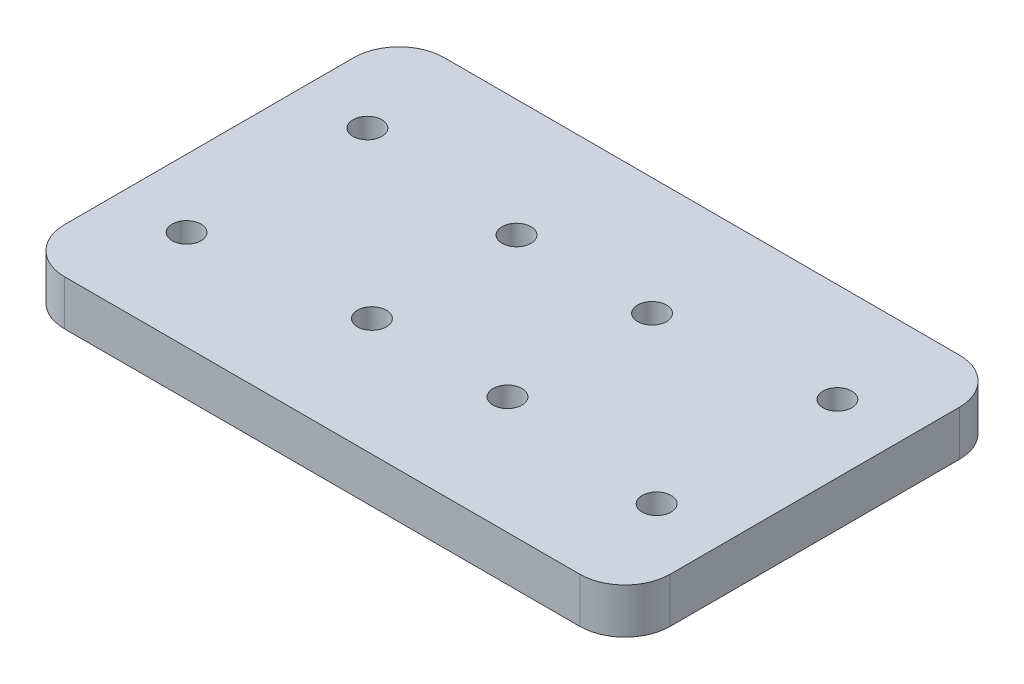
ISO-10303-21;
HEADER;
FILE_DESCRIPTION(('STEP AP214'),'2;1');
FILE_NAME('part.step','',(''),(''),'','','');
FILE_SCHEMA(('AUTOMOTIVE_DESIGN { 1 0 10303 214 1 1 1 1 }'));
ENDSEC;
DATA;
#1=APPLICATION_CONTEXT('core data for automotive mechanical design processes');
#2=APPLICATION_PROTOCOL_DEFINITION('international standard','automotive_design',2000,#1);
#3=PRODUCT_CONTEXT('',#1,'mechanical');
#4=PRODUCT('Part','Part','',(#3));
#5=PRODUCT_RELATED_PRODUCT_CATEGORY('part','',(#4));
#6=PRODUCT_DEFINITION_FORMATION('','',#4);
#7=PRODUCT_DEFINITION_CONTEXT('part definition',#1,'design');
#8=PRODUCT_DEFINITION('design','',#6,#7);
#9=PRODUCT_DEFINITION_SHAPE('','',#8);
#10=(LENGTH_UNIT() NAMED_UNIT(*) SI_UNIT(.MILLI.,.METRE.));
#11=(NAMED_UNIT(*) PLANE_ANGLE_UNIT() SI_UNIT($,.RADIAN.));
#12=(NAMED_UNIT(*) SI_UNIT($,.STERADIAN.) SOLID_ANGLE_UNIT());
#13=UNCERTAINTY_MEASURE_WITH_UNIT(LENGTH_MEASURE(1.E-05),#10,'distance_accuracy_value','');
#14=(GEOMETRIC_REPRESENTATION_CONTEXT(3) GLOBAL_UNCERTAINTY_ASSIGNED_CONTEXT((#13)) GLOBAL_UNIT_ASSIGNED_CONTEXT((#10,
#11,#12)) REPRESENTATION_CONTEXT('',''));
#15=CARTESIAN_POINT('',(0.,0.,0.));
#16=DIRECTION('',(0.,0.,1.));
#17=DIRECTION('',(1.,0.,0.));
#18=AXIS2_PLACEMENT_3D('',#15,#16,#17);
#19=CARTESIAN_POINT('',(0.,5.,0.));
#20=DIRECTION('',(0.,-1.,0.));
#21=DIRECTION('',(0.,0.,-1.));
#22=AXIS2_PLACEMENT_3D('',#19,#20,#21);
#23=PLANE('',#22);
#24=CARTESIAN_POINT('',(26.,5.,-29.));
#25=DIRECTION('',(0.,1.,0.));
#26=DIRECTION('',(0.,0.,1.));
#27=AXIS2_PLACEMENT_3D('',#24,#25,#26);
#28=CIRCLE('',#27,1.6);
#29=CARTESIAN_POINT('',(26.,5.,-27.4));
#30=VERTEX_POINT('',#29);
#31=EDGE_CURVE('E257',#30,#30,#28,.T.);
#32=ORIENTED_EDGE('',*,*,#31,.F.);
#33=EDGE_LOOP('',(#32));
#34=FACE_BOUND('',#33,.T.);
#35=CARTESIAN_POINT('',(26.,5.,-13.));
#36=DIRECTION('',(0.,1.,0.));
#37=DIRECTION('',(0.,0.,1.));
#38=AXIS2_PLACEMENT_3D('',#35,#36,#37);
#39=CIRCLE('',#38,1.6);
#40=CARTESIAN_POINT('',(26.,5.,-11.4));
#41=VERTEX_POINT('',#40);
#42=EDGE_CURVE('E265',#41,#41,#39,.T.);
#43=ORIENTED_EDGE('',*,*,#42,.F.);
#44=EDGE_LOOP('',(#43));
#45=FACE_BOUND('',#44,.T.);
#46=CARTESIAN_POINT('',(41.,5.,-13.));
#47=DIRECTION('',(0.,1.,0.));
#48=DIRECTION('',(0.,0.,1.));
#49=AXIS2_PLACEMENT_3D('',#46,#47,#48);
#50=CIRCLE('',#49,1.6);
#51=CARTESIAN_POINT('',(41.,5.,-11.4));
#52=VERTEX_POINT('',#51);
#53=EDGE_CURVE('E249',#52,#52,#50,.T.);
#54=ORIENTED_EDGE('',*,*,#53,.F.);
#55=EDGE_LOOP('',(#54));
#56=FACE_BOUND('',#55,.T.);
#57=CARTESIAN_POINT('',(41.,5.,-29.));
#58=DIRECTION('',(0.,1.,0.));
#59=DIRECTION('',(0.,0.,1.));
#60=AXIS2_PLACEMENT_3D('',#57,#58,#59);
#61=CIRCLE('',#60,1.6);
#62=CARTESIAN_POINT('',(41.,5.,-27.4));
#63=VERTEX_POINT('',#62);
#64=EDGE_CURVE('E245',#63,#63,#61,.T.);
#65=ORIENTED_EDGE('',*,*,#64,.F.);
#66=EDGE_LOOP('',(#65));
#67=FACE_BOUND('',#66,.T.);
#68=DIRECTION('',(-1.,0.,0.));
#69=VECTOR('',#68,1.);
#70=CARTESIAN_POINT('',(0.,5.,-42.));
#71=LINE('',#70,#69);
#72=CARTESIAN_POINT('',(62.,5.,-42.));
#73=VERTEX_POINT('',#72);
#74=CARTESIAN_POINT('',(5.,5.,-42.));
#75=VERTEX_POINT('',#74);
#76=EDGE_CURVE('E154',#73,#75,#71,.T.);
#77=ORIENTED_EDGE('',*,*,#76,.T.);
#78=CARTESIAN_POINT('',(5.,5.,-37.));
#79=DIRECTION('',(0.,-1.,0.));
#80=DIRECTION('',(0.,0.,-1.));
#81=AXIS2_PLACEMENT_3D('',#78,#79,#80);
#82=CIRCLE('',#81,5.);
#83=CARTESIAN_POINT('',(0.,5.,-37.));
#84=VERTEX_POINT('',#83);
#85=EDGE_CURVE('E184',#75,#84,#82,.F.);
#86=ORIENTED_EDGE('',*,*,#85,.T.);
#87=DIRECTION('',(0.,0.,1.));
#88=VECTOR('',#87,1.);
#89=CARTESIAN_POINT('',(0.,5.,0.));
#90=LINE('',#89,#88);
#91=CARTESIAN_POINT('',(0.,5.,-5.));
#92=VERTEX_POINT('',#91);
#93=EDGE_CURVE('E133',#84,#92,#90,.T.);
#94=ORIENTED_EDGE('',*,*,#93,.T.);
#95=CARTESIAN_POINT('',(5.,5.,-5.));
#96=DIRECTION('',(0.,-1.,0.));
#97=DIRECTION('',(0.,0.,-1.));
#98=AXIS2_PLACEMENT_3D('',#95,#96,#97);
#99=CIRCLE('',#98,5.);
#100=CARTESIAN_POINT('',(5.,5.,0.));
#101=VERTEX_POINT('',#100);
#102=EDGE_CURVE('E176',#92,#101,#99,.F.);
#103=ORIENTED_EDGE('',*,*,#102,.T.);
#104=DIRECTION('',(1.,0.,0.));
#105=VECTOR('',#104,1.);
#106=CARTESIAN_POINT('',(0.,5.,0.));
#107=LINE('',#106,#105);
#108=CARTESIAN_POINT('',(62.,5.,0.));
#109=VERTEX_POINT('',#108);
#110=EDGE_CURVE('E199',#101,#109,#107,.T.);
#111=ORIENTED_EDGE('',*,*,#110,.T.);
#112=CARTESIAN_POINT('',(62.,5.,-5.));
#113=DIRECTION('',(0.,-1.,0.));
#114=DIRECTION('',(0.,0.,-1.));
#115=AXIS2_PLACEMENT_3D('',#112,#113,#114);
#116=CIRCLE('',#115,5.);
#117=CARTESIAN_POINT('',(67.,5.,-5.));
#118=VERTEX_POINT('',#117);
#119=EDGE_CURVE('E68',#109,#118,#116,.F.);
#120=ORIENTED_EDGE('',*,*,#119,.T.);
#121=DIRECTION('',(0.,0.,-1.));
#122=VECTOR('',#121,1.);
#123=CARTESIAN_POINT('',(67.,5.,0.));
#124=LINE('',#123,#122);
#125=CARTESIAN_POINT('',(67.,5.,-37.));
#126=VERTEX_POINT('',#125);
#127=EDGE_CURVE('E207',#118,#126,#124,.T.);
#128=ORIENTED_EDGE('',*,*,#127,.T.);
#129=CARTESIAN_POINT('',(62.,5.,-37.));
#130=DIRECTION('',(0.,-1.,0.));
#131=DIRECTION('',(0.,0.,-1.));
#132=AXIS2_PLACEMENT_3D('',#129,#130,#131);
#133=CIRCLE('',#132,5.);
#134=EDGE_CURVE('E181',#126,#73,#133,.F.);
#135=ORIENTED_EDGE('',*,*,#134,.T.);
#136=EDGE_LOOP('',(#77,#86,#94,#103,#111,#120,#128,#135));
#137=FACE_BOUND('',#136,.T.);
#138=CARTESIAN_POINT('',(7.50000000000001,5.,-31.));
#139=DIRECTION('',(0.,1.,0.));
#140=DIRECTION('',(0.,0.,1.));
#141=AXIS2_PLACEMENT_3D('',#138,#139,#140);
#142=CIRCLE('',#141,1.6);
#143=CARTESIAN_POINT('',(7.50000000000001,5.,-29.4));
#144=VERTEX_POINT('',#143);
#145=EDGE_CURVE('E143',#144,#144,#142,.T.);
#146=ORIENTED_EDGE('',*,*,#145,.F.);
#147=EDGE_LOOP('',(#146));
#148=FACE_BOUND('',#147,.T.);
#149=CARTESIAN_POINT('',(7.50000000000001,5.,-11.));
#150=DIRECTION('',(0.,1.,0.));
#151=DIRECTION('',(0.,0.,1.));
#152=AXIS2_PLACEMENT_3D('',#149,#150,#151);
#153=CIRCLE('',#152,1.6);
#154=CARTESIAN_POINT('',(7.50000000000001,5.,-9.4));
#155=VERTEX_POINT('',#154);
#156=EDGE_CURVE('E219',#155,#155,#153,.T.);
#157=ORIENTED_EDGE('',*,*,#156,.F.);
#158=EDGE_LOOP('',(#157));
#159=FACE_BOUND('',#158,.T.);
#160=CARTESIAN_POINT('',(59.5,5.,-11.));
#161=DIRECTION('',(0.,1.,0.));
#162=DIRECTION('',(0.,0.,-1.));
#163=AXIS2_PLACEMENT_3D('',#160,#161,#162);
#164=CIRCLE('',#163,1.6);
#165=CARTESIAN_POINT('',(59.5,5.,-12.6));
#166=VERTEX_POINT('',#165);
#167=EDGE_CURVE('E225',#166,#166,#164,.T.);
#168=ORIENTED_EDGE('',*,*,#167,.F.);
#169=EDGE_LOOP('',(#168));
#170=FACE_BOUND('',#169,.T.);
#171=CARTESIAN_POINT('',(59.5,5.,-31.));
#172=DIRECTION('',(0.,1.,0.));
#173=DIRECTION('',(0.,0.,-1.));
#174=AXIS2_PLACEMENT_3D('',#171,#172,#173);
#175=CIRCLE('',#174,1.6);
#176=CARTESIAN_POINT('',(59.5,5.,-32.6));
#177=VERTEX_POINT('',#176);
#178=EDGE_CURVE('E233',#177,#177,#175,.T.);
#179=ORIENTED_EDGE('',*,*,#178,.F.);
#180=EDGE_LOOP('',(#179));
#181=FACE_BOUND('',#180,.T.);
#182=ADVANCED_FACE('F45',(#34,#45,#56,#67,#137,#148,#159,#170,#181),#23,.F.);
#183=CARTESIAN_POINT('',(0.,0.,0.));
#184=DIRECTION('',(0.,-1.,0.));
#185=DIRECTION('',(0.,0.,-1.));
#186=AXIS2_PLACEMENT_3D('',#183,#184,#185);
#187=PLANE('',#186);
#188=CARTESIAN_POINT('',(26.,0.,-29.));
#189=DIRECTION('',(0.,1.,0.));
#190=DIRECTION('',(0.,0.,1.));
#191=AXIS2_PLACEMENT_3D('',#188,#189,#190);
#192=CIRCLE('',#191,1.6);
#193=CARTESIAN_POINT('',(26.,0.,-27.4));
#194=VERTEX_POINT('',#193);
#195=EDGE_CURVE('E253',#194,#194,#192,.T.);
#196=ORIENTED_EDGE('',*,*,#195,.T.);
#197=EDGE_LOOP('',(#196));
#198=FACE_BOUND('',#197,.T.);
#199=CARTESIAN_POINT('',(26.,0.,-13.));
#200=DIRECTION('',(0.,1.,0.));
#201=DIRECTION('',(0.,0.,1.));
#202=AXIS2_PLACEMENT_3D('',#199,#200,#201);
#203=CIRCLE('',#202,1.6);
#204=CARTESIAN_POINT('',(26.,0.,-11.4));
#205=VERTEX_POINT('',#204);
#206=EDGE_CURVE('E261',#205,#205,#203,.T.);
#207=ORIENTED_EDGE('',*,*,#206,.T.);
#208=EDGE_LOOP('',(#207));
#209=FACE_BOUND('',#208,.T.);
#210=CARTESIAN_POINT('',(41.,0.,-13.));
#211=DIRECTION('',(0.,1.,0.));
#212=DIRECTION('',(0.,0.,1.));
#213=AXIS2_PLACEMENT_3D('',#210,#211,#212);
#214=CIRCLE('',#213,1.6);
#215=CARTESIAN_POINT('',(41.,0.,-11.4));
#216=VERTEX_POINT('',#215);
#217=EDGE_CURVE('E269',#216,#216,#214,.T.);
#218=ORIENTED_EDGE('',*,*,#217,.T.);
#219=EDGE_LOOP('',(#218));
#220=FACE_BOUND('',#219,.T.);
#221=CARTESIAN_POINT('',(41.,0.,-29.));
#222=DIRECTION('',(0.,1.,0.));
#223=DIRECTION('',(0.,0.,1.));
#224=AXIS2_PLACEMENT_3D('',#221,#222,#223);
#225=CIRCLE('',#224,1.6);
#226=CARTESIAN_POINT('',(41.,0.,-27.4));
#227=VERTEX_POINT('',#226);
#228=EDGE_CURVE('E241',#227,#227,#225,.T.);
#229=ORIENTED_EDGE('',*,*,#228,.T.);
#230=EDGE_LOOP('',(#229));
#231=FACE_BOUND('',#230,.T.);
#232=CARTESIAN_POINT('',(59.5,0.,-11.));
#233=DIRECTION('',(0.,1.,0.));
#234=DIRECTION('',(0.,0.,-1.));
#235=AXIS2_PLACEMENT_3D('',#232,#233,#234);
#236=CIRCLE('',#235,1.6);
#237=CARTESIAN_POINT('',(59.5,0.,-12.6));
#238=VERTEX_POINT('',#237);
#239=EDGE_CURVE('E229',#238,#238,#236,.T.);
#240=ORIENTED_EDGE('',*,*,#239,.T.);
#241=EDGE_LOOP('',(#240));
#242=FACE_BOUND('',#241,.T.);
#243=CARTESIAN_POINT('',(7.50000000000001,0.,-31.));
#244=DIRECTION('',(0.,1.,0.));
#245=DIRECTION('',(0.,0.,1.));
#246=AXIS2_PLACEMENT_3D('',#243,#244,#245);
#247=CIRCLE('',#246,1.6);
#248=CARTESIAN_POINT('',(7.50000000000001,0.,-29.4));
#249=VERTEX_POINT('',#248);
#250=EDGE_CURVE('E151',#249,#249,#247,.T.);
#251=ORIENTED_EDGE('',*,*,#250,.T.);
#252=EDGE_LOOP('',(#251));
#253=FACE_BOUND('',#252,.T.);
#254=DIRECTION('',(0.,0.,1.));
#255=VECTOR('',#254,1.);
#256=CARTESIAN_POINT('',(0.,0.,0.));
#257=LINE('',#256,#255);
#258=CARTESIAN_POINT('',(0.,0.,-37.));
#259=VERTEX_POINT('',#258);
#260=CARTESIAN_POINT('',(0.,0.,-5.));
#261=VERTEX_POINT('',#260);
#262=EDGE_CURVE('E130',#259,#261,#257,.T.);
#263=ORIENTED_EDGE('',*,*,#262,.F.);
#264=CARTESIAN_POINT('',(5.,0.,-37.));
#265=DIRECTION('',(0.,-1.,0.));
#266=DIRECTION('',(0.,0.,-1.));
#267=AXIS2_PLACEMENT_3D('',#264,#265,#266);
#268=CIRCLE('',#267,5.);
#269=CARTESIAN_POINT('',(5.,0.,-42.));
#270=VERTEX_POINT('',#269);
#271=EDGE_CURVE('E112',#259,#270,#268,.T.);
#272=ORIENTED_EDGE('',*,*,#271,.T.);
#273=DIRECTION('',(-1.,0.,0.));
#274=VECTOR('',#273,1.);
#275=CARTESIAN_POINT('',(0.,0.,-42.));
#276=LINE('',#275,#274);
#277=CARTESIAN_POINT('',(62.,0.,-42.));
#278=VERTEX_POINT('',#277);
#279=EDGE_CURVE('E159',#278,#270,#276,.T.);
#280=ORIENTED_EDGE('',*,*,#279,.F.);
#281=CARTESIAN_POINT('',(62.,0.,-37.));
#282=DIRECTION('',(0.,-1.,0.));
#283=DIRECTION('',(0.,0.,-1.));
#284=AXIS2_PLACEMENT_3D('',#281,#282,#283);
#285=CIRCLE('',#284,5.);
#286=CARTESIAN_POINT('',(67.,0.,-37.));
#287=VERTEX_POINT('',#286);
#288=EDGE_CURVE('E124',#278,#287,#285,.T.);
#289=ORIENTED_EDGE('',*,*,#288,.T.);
#290=DIRECTION('',(0.,0.,-1.));
#291=VECTOR('',#290,1.);
#292=CARTESIAN_POINT('',(67.,0.,0.));
#293=LINE('',#292,#291);
#294=CARTESIAN_POINT('',(67.,0.,-5.));
#295=VERTEX_POINT('',#294);
#296=EDGE_CURVE('E148',#295,#287,#293,.T.);
#297=ORIENTED_EDGE('',*,*,#296,.F.);
#298=CARTESIAN_POINT('',(62.,0.,-5.));
#299=DIRECTION('',(0.,-1.,0.));
#300=DIRECTION('',(0.,0.,-1.));
#301=AXIS2_PLACEMENT_3D('',#298,#299,#300);
#302=CIRCLE('',#301,5.);
#303=CARTESIAN_POINT('',(62.,0.,0.));
#304=VERTEX_POINT('',#303);
#305=EDGE_CURVE('E166',#295,#304,#302,.T.);
#306=ORIENTED_EDGE('',*,*,#305,.T.);
#307=DIRECTION('',(1.,0.,0.));
#308=VECTOR('',#307,1.);
#309=CARTESIAN_POINT('',(0.,0.,0.));
#310=LINE('',#309,#308);
#311=CARTESIAN_POINT('',(5.,0.,0.));
#312=VERTEX_POINT('',#311);
#313=EDGE_CURVE('E142',#312,#304,#310,.T.);
#314=ORIENTED_EDGE('',*,*,#313,.F.);
#315=CARTESIAN_POINT('',(5.,0.,-5.));
#316=DIRECTION('',(0.,-1.,0.));
#317=DIRECTION('',(0.,0.,-1.));
#318=AXIS2_PLACEMENT_3D('',#315,#316,#317);
#319=CIRCLE('',#318,5.);
#320=EDGE_CURVE('E135',#312,#261,#319,.T.);
#321=ORIENTED_EDGE('',*,*,#320,.T.);
#322=EDGE_LOOP('',(#263,#272,#280,#289,#297,#306,#314,#321));
#323=FACE_BOUND('',#322,.T.);
#324=CARTESIAN_POINT('',(7.50000000000001,0.,-11.));
#325=DIRECTION('',(0.,1.,0.));
#326=DIRECTION('',(0.,0.,1.));
#327=AXIS2_PLACEMENT_3D('',#324,#325,#326);
#328=CIRCLE('',#327,1.6);
#329=CARTESIAN_POINT('',(7.50000000000001,0.,-9.4));
#330=VERTEX_POINT('',#329);
#331=EDGE_CURVE('E221',#330,#330,#328,.T.);
#332=ORIENTED_EDGE('',*,*,#331,.T.);
#333=EDGE_LOOP('',(#332));
#334=FACE_BOUND('',#333,.T.);
#335=CARTESIAN_POINT('',(59.5,0.,-31.));
#336=DIRECTION('',(0.,1.,0.));
#337=DIRECTION('',(0.,0.,-1.));
#338=AXIS2_PLACEMENT_3D('',#335,#336,#337);
#339=CIRCLE('',#338,1.6);
#340=CARTESIAN_POINT('',(59.5,0.,-32.6));
#341=VERTEX_POINT('',#340);
#342=EDGE_CURVE('E237',#341,#341,#339,.T.);
#343=ORIENTED_EDGE('',*,*,#342,.T.);
#344=EDGE_LOOP('',(#343));
#345=FACE_BOUND('',#344,.T.);
#346=ADVANCED_FACE('F138',(#198,#209,#220,#231,#242,#253,#323,#334,#345),#187,.T.);
#347=CARTESIAN_POINT('',(0.,5.,0.));
#348=DIRECTION('',(1.,0.,0.));
#349=DIRECTION('',(0.,0.,-1.));
#350=AXIS2_PLACEMENT_3D('',#347,#348,#349);
#351=PLANE('',#350);
#352=ORIENTED_EDGE('',*,*,#93,.F.);
#353=DIRECTION('',(0.,-1.,0.));
#354=VECTOR('',#353,1.);
#355=CARTESIAN_POINT('',(0.,5.,-37.));
#356=LINE('',#355,#354);
#357=EDGE_CURVE('E116',#84,#259,#356,.T.);
#358=ORIENTED_EDGE('',*,*,#357,.T.);
#359=ORIENTED_EDGE('',*,*,#262,.T.);
#360=DIRECTION('',(0.,-1.,0.));
#361=VECTOR('',#360,1.);
#362=CARTESIAN_POINT('',(0.,5.,-5.));
#363=LINE('',#362,#361);
#364=EDGE_CURVE('E136',#261,#92,#363,.F.);
#365=ORIENTED_EDGE('',*,*,#364,.T.);
#366=EDGE_LOOP('',(#352,#358,#359,#365));
#367=FACE_BOUND('',#366,.T.);
#368=ADVANCED_FACE('F129',(#367),#351,.F.);
#369=CARTESIAN_POINT('',(0.,5.,0.));
#370=DIRECTION('',(0.,0.,-1.));
#371=DIRECTION('',(-1.,0.,0.));
#372=AXIS2_PLACEMENT_3D('',#369,#370,#371);
#373=PLANE('',#372);
#374=ORIENTED_EDGE('',*,*,#313,.T.);
#375=DIRECTION('',(0.,-1.,0.));
#376=VECTOR('',#375,1.);
#377=CARTESIAN_POINT('',(62.,5.,0.));
#378=LINE('',#377,#376);
#379=EDGE_CURVE('E11',#304,#109,#378,.F.);
#380=ORIENTED_EDGE('',*,*,#379,.T.);
#381=ORIENTED_EDGE('',*,*,#110,.F.);
#382=DIRECTION('',(0.,-1.,0.));
#383=VECTOR('',#382,1.);
#384=CARTESIAN_POINT('',(5.,5.,0.));
#385=LINE('',#384,#383);
#386=EDGE_CURVE('E54',#101,#312,#385,.T.);
#387=ORIENTED_EDGE('',*,*,#386,.T.);
#388=EDGE_LOOP('',(#374,#380,#381,#387));
#389=FACE_BOUND('',#388,.T.);
#390=ADVANCED_FACE('F197',(#389),#373,.F.);
#391=CARTESIAN_POINT('',(67.,5.,0.));
#392=DIRECTION('',(-1.,0.,0.));
#393=DIRECTION('',(0.,0.,1.));
#394=AXIS2_PLACEMENT_3D('',#391,#392,#393);
#395=PLANE('',#394);
#396=ORIENTED_EDGE('',*,*,#296,.T.);
#397=DIRECTION('',(0.,-1.,0.));
#398=VECTOR('',#397,1.);
#399=CARTESIAN_POINT('',(67.,5.,-37.));
#400=LINE('',#399,#398);
#401=EDGE_CURVE('E61',#287,#126,#400,.F.);
#402=ORIENTED_EDGE('',*,*,#401,.T.);
#403=ORIENTED_EDGE('',*,*,#127,.F.);
#404=DIRECTION('',(0.,-1.,0.));
#405=VECTOR('',#404,1.);
#406=CARTESIAN_POINT('',(67.,5.,-5.));
#407=LINE('',#406,#405);
#408=EDGE_CURVE('E187',#118,#295,#407,.T.);
#409=ORIENTED_EDGE('',*,*,#408,.T.);
#410=EDGE_LOOP('',(#396,#402,#403,#409));
#411=FACE_BOUND('',#410,.T.);
#412=ADVANCED_FACE('F206',(#411),#395,.F.);
#413=CARTESIAN_POINT('',(0.,5.,-42.));
#414=DIRECTION('',(0.,0.,1.));
#415=DIRECTION('',(1.,0.,0.));
#416=AXIS2_PLACEMENT_3D('',#413,#414,#415);
#417=PLANE('',#416);
#418=ORIENTED_EDGE('',*,*,#279,.T.);
#419=DIRECTION('',(0.,-1.,0.));
#420=VECTOR('',#419,1.);
#421=CARTESIAN_POINT('',(5.,5.,-42.));
#422=LINE('',#421,#420);
#423=EDGE_CURVE('E117',#270,#75,#422,.F.);
#424=ORIENTED_EDGE('',*,*,#423,.T.);
#425=ORIENTED_EDGE('',*,*,#76,.F.);
#426=DIRECTION('',(0.,-1.,0.));
#427=VECTOR('',#426,1.);
#428=CARTESIAN_POINT('',(62.,5.,-42.));
#429=LINE('',#428,#427);
#430=EDGE_CURVE('E123',#73,#278,#429,.T.);
#431=ORIENTED_EDGE('',*,*,#430,.T.);
#432=EDGE_LOOP('',(#418,#424,#425,#431));
#433=FACE_BOUND('',#432,.T.);
#434=ADVANCED_FACE('F312',(#433),#417,.F.);
#435=CARTESIAN_POINT('',(7.50000000000001,5.,-31.));
#436=DIRECTION('',(0.,-1.,0.));
#437=DIRECTION('',(0.,0.,-1.));
#438=AXIS2_PLACEMENT_3D('',#435,#436,#437);
#439=CYLINDRICAL_SURFACE('',#438,1.6);
#440=ORIENTED_EDGE('',*,*,#145,.T.);
#441=EDGE_LOOP('',(#440));
#442=FACE_BOUND('',#441,.T.);
#443=ORIENTED_EDGE('',*,*,#250,.F.);
#444=EDGE_LOOP('',(#443));
#445=FACE_BOUND('',#444,.T.);
#446=ADVANCED_FACE('F315',(#442,#445),#439,.F.);
#447=CARTESIAN_POINT('',(7.50000000000001,5.,-11.));
#448=DIRECTION('',(0.,-1.,0.));
#449=DIRECTION('',(0.,0.,-1.));
#450=AXIS2_PLACEMENT_3D('',#447,#448,#449);
#451=CYLINDRICAL_SURFACE('',#450,1.6);
#452=ORIENTED_EDGE('',*,*,#156,.T.);
#453=EDGE_LOOP('',(#452));
#454=FACE_BOUND('',#453,.T.);
#455=ORIENTED_EDGE('',*,*,#331,.F.);
#456=EDGE_LOOP('',(#455));
#457=FACE_BOUND('',#456,.T.);
#458=ADVANCED_FACE('F402',(#454,#457),#451,.F.);
#459=CARTESIAN_POINT('',(59.5,5.,-11.));
#460=DIRECTION('',(0.,-1.,0.));
#461=DIRECTION('',(0.,0.,-1.));
#462=AXIS2_PLACEMENT_3D('',#459,#460,#461);
#463=CYLINDRICAL_SURFACE('',#462,1.6);
#464=ORIENTED_EDGE('',*,*,#167,.T.);
#465=EDGE_LOOP('',(#464));
#466=FACE_BOUND('',#465,.T.);
#467=ORIENTED_EDGE('',*,*,#239,.F.);
#468=EDGE_LOOP('',(#467));
#469=FACE_BOUND('',#468,.T.);
#470=ADVANCED_FACE('F298',(#466,#469),#463,.F.);
#471=CARTESIAN_POINT('',(59.5,5.,-31.));
#472=DIRECTION('',(0.,-1.,0.));
#473=DIRECTION('',(0.,0.,-1.));
#474=AXIS2_PLACEMENT_3D('',#471,#472,#473);
#475=CYLINDRICAL_SURFACE('',#474,1.6);
#476=ORIENTED_EDGE('',*,*,#178,.T.);
#477=EDGE_LOOP('',(#476));
#478=FACE_BOUND('',#477,.T.);
#479=ORIENTED_EDGE('',*,*,#342,.F.);
#480=EDGE_LOOP('',(#479));
#481=FACE_BOUND('',#480,.T.);
#482=ADVANCED_FACE('F294',(#478,#481),#475,.F.);
#483=CARTESIAN_POINT('',(41.,0.,-29.));
#484=DIRECTION('',(0.,1.,0.));
#485=DIRECTION('',(0.,0.,1.));
#486=AXIS2_PLACEMENT_3D('',#483,#484,#485);
#487=CYLINDRICAL_SURFACE('',#486,1.6);
#488=ORIENTED_EDGE('',*,*,#228,.F.);
#489=EDGE_LOOP('',(#488));
#490=FACE_BOUND('',#489,.T.);
#491=ORIENTED_EDGE('',*,*,#64,.T.);
#492=EDGE_LOOP('',(#491));
#493=FACE_BOUND('',#492,.T.);
#494=ADVANCED_FACE('F297',(#490,#493),#487,.F.);
#495=CARTESIAN_POINT('',(41.,0.,-13.));
#496=DIRECTION('',(0.,1.,0.));
#497=DIRECTION('',(0.,0.,1.));
#498=AXIS2_PLACEMENT_3D('',#495,#496,#497);
#499=CYLINDRICAL_SURFACE('',#498,1.6);
#500=ORIENTED_EDGE('',*,*,#217,.F.);
#501=EDGE_LOOP('',(#500));
#502=FACE_BOUND('',#501,.T.);
#503=ORIENTED_EDGE('',*,*,#53,.T.);
#504=EDGE_LOOP('',(#503));
#505=FACE_BOUND('',#504,.T.);
#506=ADVANCED_FACE('F277',(#502,#505),#499,.F.);
#507=CARTESIAN_POINT('',(26.,0.,-13.));
#508=DIRECTION('',(0.,1.,0.));
#509=DIRECTION('',(0.,0.,1.));
#510=AXIS2_PLACEMENT_3D('',#507,#508,#509);
#511=CYLINDRICAL_SURFACE('',#510,1.6);
#512=ORIENTED_EDGE('',*,*,#206,.F.);
#513=EDGE_LOOP('',(#512));
#514=FACE_BOUND('',#513,.T.);
#515=ORIENTED_EDGE('',*,*,#42,.T.);
#516=EDGE_LOOP('',(#515));
#517=FACE_BOUND('',#516,.T.);
#518=ADVANCED_FACE('F359',(#514,#517),#511,.F.);
#519=CARTESIAN_POINT('',(26.,0.,-29.));
#520=DIRECTION('',(0.,1.,0.));
#521=DIRECTION('',(0.,0.,1.));
#522=AXIS2_PLACEMENT_3D('',#519,#520,#521);
#523=CYLINDRICAL_SURFACE('',#522,1.6);
#524=ORIENTED_EDGE('',*,*,#195,.F.);
#525=EDGE_LOOP('',(#524));
#526=FACE_BOUND('',#525,.T.);
#527=ORIENTED_EDGE('',*,*,#31,.T.);
#528=EDGE_LOOP('',(#527));
#529=FACE_BOUND('',#528,.T.);
#530=ADVANCED_FACE('F324',(#526,#529),#523,.F.);
#531=CARTESIAN_POINT('',(5.,5.,-37.));
#532=DIRECTION('',(0.,-1.,0.));
#533=DIRECTION('',(0.,0.,-1.));
#534=AXIS2_PLACEMENT_3D('',#531,#532,#533);
#535=CYLINDRICAL_SURFACE('',#534,5.);
#536=ORIENTED_EDGE('',*,*,#85,.F.);
#537=ORIENTED_EDGE('',*,*,#423,.F.);
#538=ORIENTED_EDGE('',*,*,#271,.F.);
#539=ORIENTED_EDGE('',*,*,#357,.F.);
#540=EDGE_LOOP('',(#536,#537,#538,#539));
#541=FACE_BOUND('',#540,.T.);
#542=ADVANCED_FACE('F115',(#541),#535,.T.);
#543=CARTESIAN_POINT('',(62.,5.,-37.));
#544=DIRECTION('',(0.,-1.,0.));
#545=DIRECTION('',(0.,0.,-1.));
#546=AXIS2_PLACEMENT_3D('',#543,#544,#545);
#547=CYLINDRICAL_SURFACE('',#546,5.);
#548=ORIENTED_EDGE('',*,*,#134,.F.);
#549=ORIENTED_EDGE('',*,*,#401,.F.);
#550=ORIENTED_EDGE('',*,*,#288,.F.);
#551=ORIENTED_EDGE('',*,*,#430,.F.);
#552=EDGE_LOOP('',(#548,#549,#550,#551));
#553=FACE_BOUND('',#552,.T.);
#554=ADVANCED_FACE('F323',(#553),#547,.T.);
#555=CARTESIAN_POINT('',(62.,5.,-5.));
#556=DIRECTION('',(0.,-1.,0.));
#557=DIRECTION('',(0.,0.,-1.));
#558=AXIS2_PLACEMENT_3D('',#555,#556,#557);
#559=CYLINDRICAL_SURFACE('',#558,5.);
#560=ORIENTED_EDGE('',*,*,#119,.F.);
#561=ORIENTED_EDGE('',*,*,#379,.F.);
#562=ORIENTED_EDGE('',*,*,#305,.F.);
#563=ORIENTED_EDGE('',*,*,#408,.F.);
#564=EDGE_LOOP('',(#560,#561,#562,#563));
#565=FACE_BOUND('',#564,.T.);
#566=ADVANCED_FACE('F205',(#565),#559,.T.);
#567=CARTESIAN_POINT('',(5.,5.,-5.));
#568=DIRECTION('',(0.,-1.,0.));
#569=DIRECTION('',(0.,0.,-1.));
#570=AXIS2_PLACEMENT_3D('',#567,#568,#569);
#571=CYLINDRICAL_SURFACE('',#570,5.);
#572=ORIENTED_EDGE('',*,*,#102,.F.);
#573=ORIENTED_EDGE('',*,*,#364,.F.);
#574=ORIENTED_EDGE('',*,*,#320,.F.);
#575=ORIENTED_EDGE('',*,*,#386,.F.);
#576=EDGE_LOOP('',(#572,#573,#574,#575));
#577=FACE_BOUND('',#576,.T.);
#578=ADVANCED_FACE('F47',(#577),#571,.T.);
#579=CLOSED_SHELL('',(#182,#346,#368,#390,#412,#434,#446,#458,#470,#482,#494,#506,#518,#530,
#542,#554,#566,#578));
#580=MANIFOLD_SOLID_BREP('B2',#579);
#581=ADVANCED_BREP_SHAPE_REPRESENTATION('',(#18,#580),#14);
#582=SHAPE_DEFINITION_REPRESENTATION(#9,#581);
ENDSEC;
END-ISO-10303-21;
